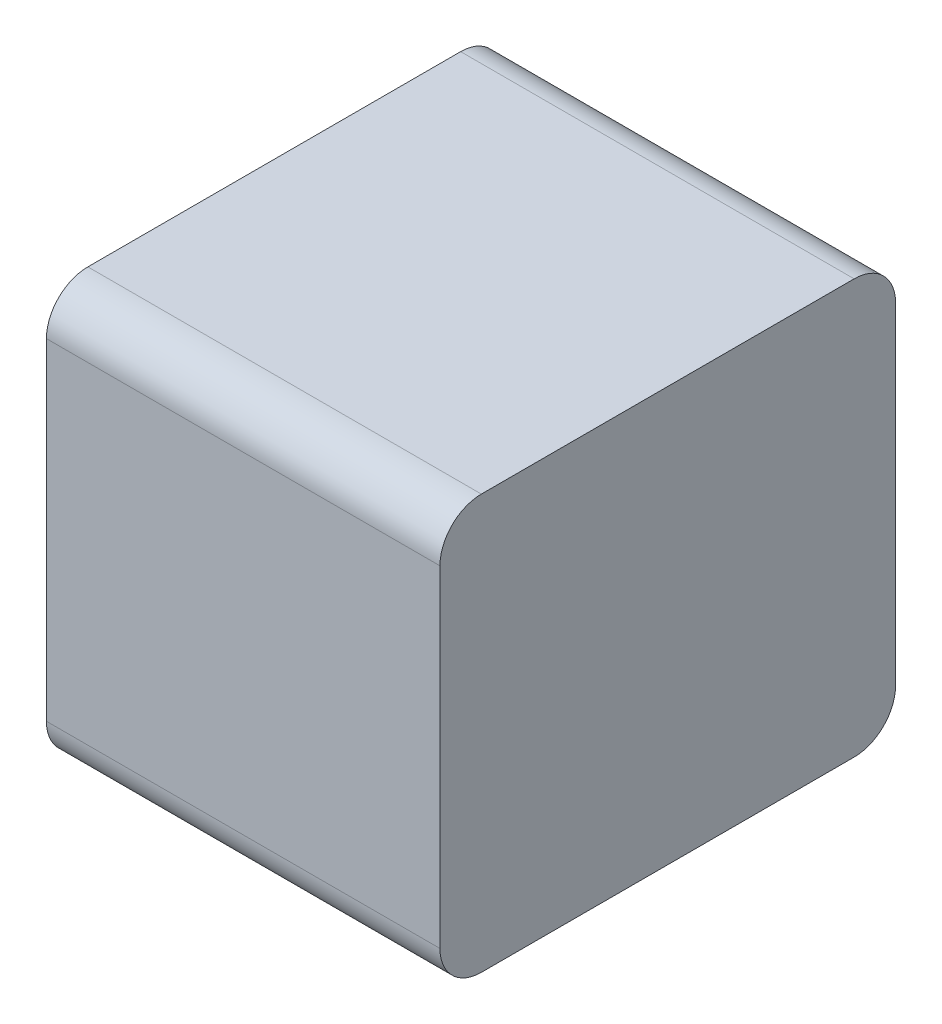
ISO-10303-21;
HEADER;
FILE_DESCRIPTION(('STEP AP214'),'2;1');
FILE_NAME('part.step','',(''),(''),'','','');
FILE_SCHEMA(('AUTOMOTIVE_DESIGN { 1 0 10303 214 1 1 1 1 }'));
ENDSEC;
DATA;
#1=APPLICATION_CONTEXT('core data for automotive mechanical design processes');
#2=APPLICATION_PROTOCOL_DEFINITION('international standard','automotive_design',2000,#1);
#3=PRODUCT_CONTEXT('',#1,'mechanical');
#4=PRODUCT('Part','Part','',(#3));
#5=PRODUCT_RELATED_PRODUCT_CATEGORY('part','',(#4));
#6=PRODUCT_DEFINITION_FORMATION('','',#4);
#7=PRODUCT_DEFINITION_CONTEXT('part definition',#1,'design');
#8=PRODUCT_DEFINITION('design','',#6,#7);
#9=PRODUCT_DEFINITION_SHAPE('','',#8);
#10=(LENGTH_UNIT() NAMED_UNIT(*) SI_UNIT(.MILLI.,.METRE.));
#11=(NAMED_UNIT(*) PLANE_ANGLE_UNIT() SI_UNIT($,.RADIAN.));
#12=(NAMED_UNIT(*) SI_UNIT($,.STERADIAN.) SOLID_ANGLE_UNIT());
#13=UNCERTAINTY_MEASURE_WITH_UNIT(LENGTH_MEASURE(1.E-05),#10,'distance_accuracy_value','');
#14=(GEOMETRIC_REPRESENTATION_CONTEXT(3) GLOBAL_UNCERTAINTY_ASSIGNED_CONTEXT((#13)) GLOBAL_UNIT_ASSIGNED_CONTEXT((#10,
#11,#12)) REPRESENTATION_CONTEXT('',''));
#15=CARTESIAN_POINT('',(0.,0.,0.));
#16=DIRECTION('',(0.,0.,1.));
#17=DIRECTION('',(1.,0.,0.));
#18=AXIS2_PLACEMENT_3D('',#15,#16,#17);
#19=CARTESIAN_POINT('',(-0.1425,0.331275705796618,0.33));
#20=DIRECTION('',(-1.,0.,0.));
#21=DIRECTION('',(0.,-1.,0.));
#22=AXIS2_PLACEMENT_3D('',#19,#20,#21);
#23=PLANE('',#22);
#24=CARTESIAN_POINT('',(-0.1425,0.12,0.3));
#25=DIRECTION('',(-1.,0.,0.));
#26=DIRECTION('',(0.,0.707106781186548,0.707106781186547));
#27=AXIS2_PLACEMENT_3D('',#24,#25,#26);
#28=CIRCLE('',#27,0.03);
#29=CARTESIAN_POINT('',(-0.1425,0.12,0.33));
#30=VERTEX_POINT('',#29);
#31=CARTESIAN_POINT('',(-0.1425,0.15,0.3));
#32=VERTEX_POINT('',#31);
#33=EDGE_CURVE('E11',#30,#32,#28,.T.);
#34=ORIENTED_EDGE('',*,*,#33,.T.);
#35=DIRECTION('',(0.,0.,-1.));
#36=VECTOR('',#35,1.);
#37=CARTESIAN_POINT('',(-0.1425,0.15,0.165));
#38=LINE('',#37,#36);
#39=CARTESIAN_POINT('',(-0.1425,0.15,0.03));
#40=VERTEX_POINT('',#39);
#41=EDGE_CURVE('E24',#32,#40,#38,.T.);
#42=ORIENTED_EDGE('',*,*,#41,.T.);
#43=CARTESIAN_POINT('',(-0.1425,0.12,0.03));
#44=DIRECTION('',(-1.,0.,0.));
#45=DIRECTION('',(0.,0.707106781186547,-0.707106781186548));
#46=AXIS2_PLACEMENT_3D('',#43,#44,#45);
#47=CIRCLE('',#46,0.03);
#48=CARTESIAN_POINT('',(-0.1425,0.12,0.));
#49=VERTEX_POINT('',#48);
#50=EDGE_CURVE('E99',#40,#49,#47,.T.);
#51=ORIENTED_EDGE('',*,*,#50,.T.);
#52=DIRECTION('',(0.,-1.,0.));
#53=VECTOR('',#52,1.);
#54=CARTESIAN_POINT('',(-0.1425,0.165637852898309,0.));
#55=LINE('',#54,#53);
#56=CARTESIAN_POINT('',(-0.1425,-0.12,0.));
#57=VERTEX_POINT('',#56);
#58=EDGE_CURVE('E128',#49,#57,#55,.T.);
#59=ORIENTED_EDGE('',*,*,#58,.T.);
#60=CARTESIAN_POINT('',(-0.1425,-0.12,0.03));
#61=DIRECTION('',(-1.,0.,0.));
#62=DIRECTION('',(0.,-0.707106781186547,-0.707106781186548));
#63=AXIS2_PLACEMENT_3D('',#60,#61,#62);
#64=CIRCLE('',#63,0.03);
#65=CARTESIAN_POINT('',(-0.1425,-0.15,0.03));
#66=VERTEX_POINT('',#65);
#67=EDGE_CURVE('E126',#57,#66,#64,.T.);
#68=ORIENTED_EDGE('',*,*,#67,.T.);
#69=DIRECTION('',(0.,0.,1.));
#70=VECTOR('',#69,1.);
#71=CARTESIAN_POINT('',(-0.1425,-0.15,0.165));
#72=LINE('',#71,#70);
#73=CARTESIAN_POINT('',(-0.1425,-0.15,0.3));
#74=VERTEX_POINT('',#73);
#75=EDGE_CURVE('E124',#66,#74,#72,.T.);
#76=ORIENTED_EDGE('',*,*,#75,.T.);
#77=CARTESIAN_POINT('',(-0.1425,-0.12,0.3));
#78=DIRECTION('',(-1.,0.,0.));
#79=DIRECTION('',(0.,-0.707106781186548,0.707106781186547));
#80=AXIS2_PLACEMENT_3D('',#77,#78,#79);
#81=CIRCLE('',#80,0.03);
#82=CARTESIAN_POINT('',(-0.1425,-0.12,0.33));
#83=VERTEX_POINT('',#82);
#84=EDGE_CURVE('E122',#74,#83,#81,.T.);
#85=ORIENTED_EDGE('',*,*,#84,.T.);
#86=DIRECTION('',(0.,1.,0.));
#87=VECTOR('',#86,1.);
#88=CARTESIAN_POINT('',(-0.1425,0.165637852898309,0.33));
#89=LINE('',#88,#87);
#90=EDGE_CURVE('E120',#83,#30,#89,.T.);
#91=ORIENTED_EDGE('',*,*,#90,.T.);
#92=EDGE_LOOP('',(#34,#42,#51,#59,#68,#76,#85,#91));
#93=FACE_BOUND('',#92,.T.);
#94=ADVANCED_FACE('F17',(#93),#23,.T.);
#95=CARTESIAN_POINT('',(0.1425,-0.331275705796618,0.33));
#96=DIRECTION('',(1.,0.,0.));
#97=DIRECTION('',(0.,1.,0.));
#98=AXIS2_PLACEMENT_3D('',#95,#96,#97);
#99=PLANE('',#98);
#100=CARTESIAN_POINT('',(0.1425,0.12,0.3));
#101=DIRECTION('',(1.,0.,0.));
#102=DIRECTION('',(0.,0.707106781186548,0.707106781186547));
#103=AXIS2_PLACEMENT_3D('',#100,#101,#102);
#104=CIRCLE('',#103,0.03);
#105=CARTESIAN_POINT('',(0.1425,0.15,0.3));
#106=VERTEX_POINT('',#105);
#107=CARTESIAN_POINT('',(0.1425,0.12,0.33));
#108=VERTEX_POINT('',#107);
#109=EDGE_CURVE('E118',#106,#108,#104,.T.);
#110=ORIENTED_EDGE('',*,*,#109,.T.);
#111=DIRECTION('',(0.,-1.,0.));
#112=VECTOR('',#111,1.);
#113=CARTESIAN_POINT('',(0.1425,-0.165637852898309,0.33));
#114=LINE('',#113,#112);
#115=CARTESIAN_POINT('',(0.1425,-0.12,0.33));
#116=VERTEX_POINT('',#115);
#117=EDGE_CURVE('E116',#108,#116,#114,.T.);
#118=ORIENTED_EDGE('',*,*,#117,.T.);
#119=CARTESIAN_POINT('',(0.1425,-0.12,0.3));
#120=DIRECTION('',(1.,0.,0.));
#121=DIRECTION('',(0.,-0.707106781186548,0.707106781186547));
#122=AXIS2_PLACEMENT_3D('',#119,#120,#121);
#123=CIRCLE('',#122,0.03);
#124=CARTESIAN_POINT('',(0.1425,-0.15,0.3));
#125=VERTEX_POINT('',#124);
#126=EDGE_CURVE('E114',#116,#125,#123,.T.);
#127=ORIENTED_EDGE('',*,*,#126,.T.);
#128=DIRECTION('',(0.,0.,-1.));
#129=VECTOR('',#128,1.);
#130=CARTESIAN_POINT('',(0.1425,-0.15,0.165));
#131=LINE('',#130,#129);
#132=CARTESIAN_POINT('',(0.1425,-0.15,0.03));
#133=VERTEX_POINT('',#132);
#134=EDGE_CURVE('E112',#125,#133,#131,.T.);
#135=ORIENTED_EDGE('',*,*,#134,.T.);
#136=CARTESIAN_POINT('',(0.1425,-0.12,0.03));
#137=DIRECTION('',(1.,0.,0.));
#138=DIRECTION('',(0.,-0.707106781186547,-0.707106781186548));
#139=AXIS2_PLACEMENT_3D('',#136,#137,#138);
#140=CIRCLE('',#139,0.03);
#141=CARTESIAN_POINT('',(0.1425,-0.12,0.));
#142=VERTEX_POINT('',#141);
#143=EDGE_CURVE('E110',#133,#142,#140,.T.);
#144=ORIENTED_EDGE('',*,*,#143,.T.);
#145=DIRECTION('',(0.,1.,0.));
#146=VECTOR('',#145,1.);
#147=CARTESIAN_POINT('',(0.1425,-0.165637852898309,0.));
#148=LINE('',#147,#146);
#149=CARTESIAN_POINT('',(0.1425,0.12,0.));
#150=VERTEX_POINT('',#149);
#151=EDGE_CURVE('E84',#142,#150,#148,.T.);
#152=ORIENTED_EDGE('',*,*,#151,.T.);
#153=CARTESIAN_POINT('',(0.1425,0.12,0.03));
#154=DIRECTION('',(1.,0.,0.));
#155=DIRECTION('',(0.,0.707106781186547,-0.707106781186548));
#156=AXIS2_PLACEMENT_3D('',#153,#154,#155);
#157=CIRCLE('',#156,0.03);
#158=CARTESIAN_POINT('',(0.1425,0.15,0.03));
#159=VERTEX_POINT('',#158);
#160=EDGE_CURVE('E78',#150,#159,#157,.T.);
#161=ORIENTED_EDGE('',*,*,#160,.T.);
#162=DIRECTION('',(0.,0.,1.));
#163=VECTOR('',#162,1.);
#164=CARTESIAN_POINT('',(0.1425,0.15,0.165));
#165=LINE('',#164,#163);
#166=EDGE_CURVE('E81',#159,#106,#165,.T.);
#167=ORIENTED_EDGE('',*,*,#166,.T.);
#168=EDGE_LOOP('',(#110,#118,#127,#135,#144,#152,#161,#167));
#169=FACE_BOUND('',#168,.T.);
#170=ADVANCED_FACE('F80',(#169),#99,.T.);
#171=CARTESIAN_POINT('',(0.,0.,0.));
#172=DIRECTION('',(0.,0.,1.));
#173=DIRECTION('',(1.,0.,0.));
#174=AXIS2_PLACEMENT_3D('',#171,#172,#173);
#175=PLANE('',#174);
#176=ORIENTED_EDGE('',*,*,#58,.F.);
#177=DIRECTION('',(-1.,0.,0.));
#178=VECTOR('',#177,1.);
#179=CARTESIAN_POINT('',(0.15,0.12,0.));
#180=LINE('',#179,#178);
#181=EDGE_CURVE('E95',#150,#49,#180,.T.);
#182=ORIENTED_EDGE('',*,*,#181,.F.);
#183=ORIENTED_EDGE('',*,*,#151,.F.);
#184=DIRECTION('',(1.,0.,0.));
#185=VECTOR('',#184,1.);
#186=CARTESIAN_POINT('',(-0.15,-0.12,0.));
#187=LINE('',#186,#185);
#188=EDGE_CURVE('E100',#57,#142,#187,.T.);
#189=ORIENTED_EDGE('',*,*,#188,.F.);
#190=EDGE_LOOP('',(#176,#182,#183,#189));
#191=FACE_BOUND('',#190,.T.);
#192=ADVANCED_FACE('F163',(#191),#175,.F.);
#193=CARTESIAN_POINT('',(0.15,0.12,0.03));
#194=DIRECTION('',(-1.,0.,0.));
#195=DIRECTION('',(0.,0.707106781186547,-0.707106781186548));
#196=AXIS2_PLACEMENT_3D('',#193,#194,#195);
#197=CYLINDRICAL_SURFACE('',#196,0.03);
#198=ORIENTED_EDGE('',*,*,#50,.F.);
#199=DIRECTION('',(1.,0.,0.));
#200=VECTOR('',#199,1.);
#201=CARTESIAN_POINT('',(0.15,0.15,0.03));
#202=LINE('',#201,#200);
#203=EDGE_CURVE('E93',#40,#159,#202,.T.);
#204=ORIENTED_EDGE('',*,*,#203,.T.);
#205=ORIENTED_EDGE('',*,*,#160,.F.);
#206=ORIENTED_EDGE('',*,*,#181,.T.);
#207=EDGE_LOOP('',(#198,#204,#205,#206));
#208=FACE_BOUND('',#207,.T.);
#209=ADVANCED_FACE('F98',(#208),#197,.T.);
#210=CARTESIAN_POINT('',(0.3,0.15,0.));
#211=DIRECTION('',(0.,1.,0.));
#212=DIRECTION('',(-1.,0.,0.));
#213=AXIS2_PLACEMENT_3D('',#210,#211,#212);
#214=PLANE('',#213);
#215=ORIENTED_EDGE('',*,*,#41,.F.);
#216=DIRECTION('',(-1.,0.,0.));
#217=VECTOR('',#216,1.);
#218=CARTESIAN_POINT('',(0.15,0.15,0.3));
#219=LINE('',#218,#217);
#220=EDGE_CURVE('E94',#106,#32,#219,.T.);
#221=ORIENTED_EDGE('',*,*,#220,.F.);
#222=ORIENTED_EDGE('',*,*,#166,.F.);
#223=ORIENTED_EDGE('',*,*,#203,.F.);
#224=EDGE_LOOP('',(#215,#221,#222,#223));
#225=FACE_BOUND('',#224,.T.);
#226=ADVANCED_FACE('F92',(#225),#214,.T.);
#227=CARTESIAN_POINT('',(0.15,0.12,0.3));
#228=DIRECTION('',(-1.,0.,0.));
#229=DIRECTION('',(0.,0.707106781186548,0.707106781186547));
#230=AXIS2_PLACEMENT_3D('',#227,#228,#229);
#231=CYLINDRICAL_SURFACE('',#230,0.03);
#232=ORIENTED_EDGE('',*,*,#33,.F.);
#233=DIRECTION('',(1.,0.,0.));
#234=VECTOR('',#233,1.);
#235=CARTESIAN_POINT('',(0.15,0.12,0.33));
#236=LINE('',#235,#234);
#237=EDGE_CURVE('E104',#30,#108,#236,.T.);
#238=ORIENTED_EDGE('',*,*,#237,.T.);
#239=ORIENTED_EDGE('',*,*,#109,.F.);
#240=ORIENTED_EDGE('',*,*,#220,.T.);
#241=EDGE_LOOP('',(#232,#238,#239,#240));
#242=FACE_BOUND('',#241,.T.);
#243=ADVANCED_FACE('F131',(#242),#231,.T.);
#244=CARTESIAN_POINT('',(-0.15,-0.12,0.03));
#245=DIRECTION('',(1.,0.,0.));
#246=DIRECTION('',(0.,-0.707106781186547,-0.707106781186548));
#247=AXIS2_PLACEMENT_3D('',#244,#245,#246);
#248=CYLINDRICAL_SURFACE('',#247,0.03);
#249=ORIENTED_EDGE('',*,*,#67,.F.);
#250=ORIENTED_EDGE('',*,*,#188,.T.);
#251=ORIENTED_EDGE('',*,*,#143,.F.);
#252=DIRECTION('',(-1.,0.,0.));
#253=VECTOR('',#252,1.);
#254=CARTESIAN_POINT('',(-0.15,-0.15,0.03));
#255=LINE('',#254,#253);
#256=EDGE_CURVE('E146',#133,#66,#255,.T.);
#257=ORIENTED_EDGE('',*,*,#256,.T.);
#258=EDGE_LOOP('',(#249,#250,#251,#257));
#259=FACE_BOUND('',#258,.T.);
#260=ADVANCED_FACE('F154',(#259),#248,.T.);
#261=CARTESIAN_POINT('',(-0.3,-0.15,0.));
#262=DIRECTION('',(0.,-1.,0.));
#263=DIRECTION('',(1.,0.,0.));
#264=AXIS2_PLACEMENT_3D('',#261,#262,#263);
#265=PLANE('',#264);
#266=ORIENTED_EDGE('',*,*,#75,.F.);
#267=ORIENTED_EDGE('',*,*,#256,.F.);
#268=ORIENTED_EDGE('',*,*,#134,.F.);
#269=DIRECTION('',(1.,0.,0.));
#270=VECTOR('',#269,1.);
#271=CARTESIAN_POINT('',(-0.15,-0.15,0.3));
#272=LINE('',#271,#270);
#273=EDGE_CURVE('E143',#74,#125,#272,.T.);
#274=ORIENTED_EDGE('',*,*,#273,.F.);
#275=EDGE_LOOP('',(#266,#267,#268,#274));
#276=FACE_BOUND('',#275,.T.);
#277=ADVANCED_FACE('F159',(#276),#265,.T.);
#278=CARTESIAN_POINT('',(-0.15,-0.12,0.3));
#279=DIRECTION('',(1.,0.,0.));
#280=DIRECTION('',(0.,-0.707106781186548,0.707106781186547));
#281=AXIS2_PLACEMENT_3D('',#278,#279,#280);
#282=CYLINDRICAL_SURFACE('',#281,0.03);
#283=ORIENTED_EDGE('',*,*,#84,.F.);
#284=ORIENTED_EDGE('',*,*,#273,.T.);
#285=ORIENTED_EDGE('',*,*,#126,.F.);
#286=DIRECTION('',(-1.,0.,0.));
#287=VECTOR('',#286,1.);
#288=CARTESIAN_POINT('',(-0.15,-0.12,0.33));
#289=LINE('',#288,#287);
#290=EDGE_CURVE('E140',#116,#83,#289,.T.);
#291=ORIENTED_EDGE('',*,*,#290,.T.);
#292=EDGE_LOOP('',(#283,#284,#285,#291));
#293=FACE_BOUND('',#292,.T.);
#294=ADVANCED_FACE('F161',(#293),#282,.T.);
#295=CARTESIAN_POINT('',(0.,0.,0.33));
#296=DIRECTION('',(0.,0.,1.));
#297=DIRECTION('',(1.,0.,0.));
#298=AXIS2_PLACEMENT_3D('',#295,#296,#297);
#299=PLANE('',#298);
#300=ORIENTED_EDGE('',*,*,#90,.F.);
#301=ORIENTED_EDGE('',*,*,#290,.F.);
#302=ORIENTED_EDGE('',*,*,#117,.F.);
#303=ORIENTED_EDGE('',*,*,#237,.F.);
#304=EDGE_LOOP('',(#300,#301,#302,#303));
#305=FACE_BOUND('',#304,.T.);
#306=ADVANCED_FACE('F138',(#305),#299,.T.);
#307=CLOSED_SHELL('',(#94,#170,#192,#209,#226,#243,#260,#277,#294,#306));
#308=MANIFOLD_SOLID_BREP('B1',#307);
#309=ADVANCED_BREP_SHAPE_REPRESENTATION('',(#18,#308),#14);
#310=SHAPE_DEFINITION_REPRESENTATION(#9,#309);
ENDSEC;
END-ISO-10303-21;
